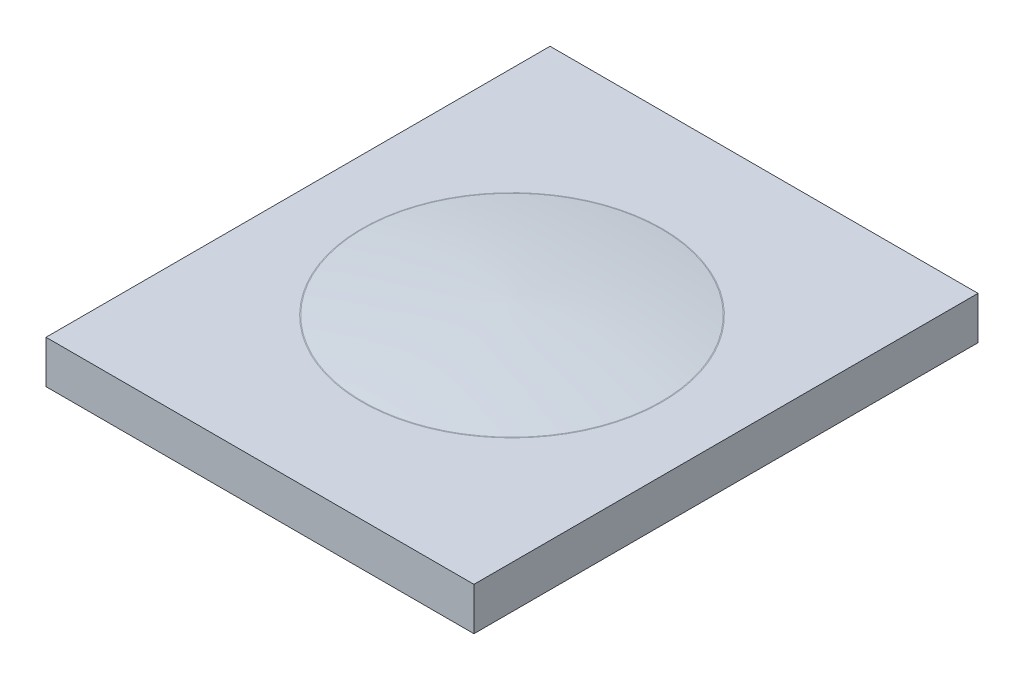
ISO-10303-21;
HEADER;
FILE_DESCRIPTION(('STEP AP214'),'2;1');
FILE_NAME('part.step','',(''),(''),'','','');
FILE_SCHEMA(('AUTOMOTIVE_DESIGN { 1 0 10303 214 1 1 1 1 }'));
ENDSEC;
DATA;
#1=APPLICATION_CONTEXT('core data for automotive mechanical design processes');
#2=APPLICATION_PROTOCOL_DEFINITION('international standard','automotive_design',2000,#1);
#3=PRODUCT_CONTEXT('',#1,'mechanical');
#4=PRODUCT('Part','Part','',(#3));
#5=PRODUCT_RELATED_PRODUCT_CATEGORY('part','',(#4));
#6=PRODUCT_DEFINITION_FORMATION('','',#4);
#7=PRODUCT_DEFINITION_CONTEXT('part definition',#1,'design');
#8=PRODUCT_DEFINITION('design','',#6,#7);
#9=PRODUCT_DEFINITION_SHAPE('','',#8);
#10=(LENGTH_UNIT() NAMED_UNIT(*) SI_UNIT(.MILLI.,.METRE.));
#11=(NAMED_UNIT(*) PLANE_ANGLE_UNIT() SI_UNIT($,.RADIAN.));
#12=(NAMED_UNIT(*) SI_UNIT($,.STERADIAN.) SOLID_ANGLE_UNIT());
#13=UNCERTAINTY_MEASURE_WITH_UNIT(LENGTH_MEASURE(1.E-05),#10,'distance_accuracy_value','');
#14=(GEOMETRIC_REPRESENTATION_CONTEXT(3) GLOBAL_UNCERTAINTY_ASSIGNED_CONTEXT((#13)) GLOBAL_UNIT_ASSIGNED_CONTEXT((#10,
#11,#12)) REPRESENTATION_CONTEXT('',''));
#15=CARTESIAN_POINT('',(0.,0.,0.));
#16=DIRECTION('',(0.,0.,1.));
#17=DIRECTION('',(1.,0.,0.));
#18=AXIS2_PLACEMENT_3D('',#15,#16,#17);
#19=CARTESIAN_POINT('',(-45.,9.,-53.));
#20=DIRECTION('',(1.,0.,0.));
#21=DIRECTION('',(0.,0.,-1.));
#22=AXIS2_PLACEMENT_3D('',#19,#20,#21);
#23=PLANE('',#22);
#24=DIRECTION('',(0.,0.,1.));
#25=VECTOR('',#24,1.);
#26=CARTESIAN_POINT('',(-45.,0.,-53.));
#27=LINE('',#26,#25);
#28=CARTESIAN_POINT('',(-45.,0.,-53.));
#29=VERTEX_POINT('',#28);
#30=CARTESIAN_POINT('',(-45.,0.,53.));
#31=VERTEX_POINT('',#30);
#32=EDGE_CURVE('E131',#29,#31,#27,.T.);
#33=ORIENTED_EDGE('',*,*,#32,.T.);
#34=DIRECTION('',(0.,-1.,0.));
#35=VECTOR('',#34,1.);
#36=CARTESIAN_POINT('',(-45.,9.,53.));
#37=LINE('',#36,#35);
#38=CARTESIAN_POINT('',(-45.,9.,53.));
#39=VERTEX_POINT('',#38);
#40=EDGE_CURVE('E129',#39,#31,#37,.T.);
#41=ORIENTED_EDGE('',*,*,#40,.F.);
#42=DIRECTION('',(0.,0.,1.));
#43=VECTOR('',#42,1.);
#44=CARTESIAN_POINT('',(-45.,9.,-53.));
#45=LINE('',#44,#43);
#46=CARTESIAN_POINT('',(-45.,9.,-53.));
#47=VERTEX_POINT('',#46);
#48=EDGE_CURVE('E126',#47,#39,#45,.T.);
#49=ORIENTED_EDGE('',*,*,#48,.F.);
#50=DIRECTION('',(0.,-1.,0.));
#51=VECTOR('',#50,1.);
#52=CARTESIAN_POINT('',(-45.,9.,-53.));
#53=LINE('',#52,#51);
#54=EDGE_CURVE('E138',#47,#29,#53,.T.);
#55=ORIENTED_EDGE('',*,*,#54,.T.);
#56=EDGE_LOOP('',(#33,#41,#49,#55));
#57=FACE_BOUND('',#56,.T.);
#58=ADVANCED_FACE('F38',(#57),#23,.F.);
#59=CARTESIAN_POINT('',(45.,9.,53.));
#60=DIRECTION('',(0.,0.,-1.));
#61=DIRECTION('',(-1.,0.,0.));
#62=AXIS2_PLACEMENT_3D('',#59,#60,#61);
#63=PLANE('',#62);
#64=DIRECTION('',(1.,0.,0.));
#65=VECTOR('',#64,1.);
#66=CARTESIAN_POINT('',(45.,0.,53.));
#67=LINE('',#66,#65);
#68=CARTESIAN_POINT('',(45.,0.,53.));
#69=VERTEX_POINT('',#68);
#70=EDGE_CURVE('E142',#31,#69,#67,.T.);
#71=ORIENTED_EDGE('',*,*,#70,.T.);
#72=DIRECTION('',(0.,-1.,0.));
#73=VECTOR('',#72,1.);
#74=CARTESIAN_POINT('',(45.,9.,53.));
#75=LINE('',#74,#73);
#76=CARTESIAN_POINT('',(45.,9.,53.));
#77=VERTEX_POINT('',#76);
#78=EDGE_CURVE('E132',#77,#69,#75,.T.);
#79=ORIENTED_EDGE('',*,*,#78,.F.);
#80=DIRECTION('',(1.,0.,0.));
#81=VECTOR('',#80,1.);
#82=CARTESIAN_POINT('',(45.,9.,53.));
#83=LINE('',#82,#81);
#84=EDGE_CURVE('E87',#39,#77,#83,.T.);
#85=ORIENTED_EDGE('',*,*,#84,.F.);
#86=ORIENTED_EDGE('',*,*,#40,.T.);
#87=EDGE_LOOP('',(#71,#79,#85,#86));
#88=FACE_BOUND('',#87,.T.);
#89=ADVANCED_FACE('F106',(#88),#63,.F.);
#90=CARTESIAN_POINT('',(45.,9.,-53.));
#91=DIRECTION('',(-1.,0.,0.));
#92=DIRECTION('',(0.,0.,1.));
#93=AXIS2_PLACEMENT_3D('',#90,#91,#92);
#94=PLANE('',#93);
#95=DIRECTION('',(0.,0.,-1.));
#96=VECTOR('',#95,1.);
#97=CARTESIAN_POINT('',(45.,0.,-53.));
#98=LINE('',#97,#96);
#99=CARTESIAN_POINT('',(45.,0.,-53.));
#100=VERTEX_POINT('',#99);
#101=EDGE_CURVE('E73',#69,#100,#98,.T.);
#102=ORIENTED_EDGE('',*,*,#101,.T.);
#103=DIRECTION('',(0.,-1.,0.));
#104=VECTOR('',#103,1.);
#105=CARTESIAN_POINT('',(45.,9.,-53.));
#106=LINE('',#105,#104);
#107=CARTESIAN_POINT('',(45.,9.,-53.));
#108=VERTEX_POINT('',#107);
#109=EDGE_CURVE('E134',#108,#100,#106,.T.);
#110=ORIENTED_EDGE('',*,*,#109,.F.);
#111=DIRECTION('',(0.,0.,-1.));
#112=VECTOR('',#111,1.);
#113=CARTESIAN_POINT('',(45.,9.,-53.));
#114=LINE('',#113,#112);
#115=EDGE_CURVE('E146',#77,#108,#114,.T.);
#116=ORIENTED_EDGE('',*,*,#115,.F.);
#117=ORIENTED_EDGE('',*,*,#78,.T.);
#118=EDGE_LOOP('',(#102,#110,#116,#117));
#119=FACE_BOUND('',#118,.T.);
#120=ADVANCED_FACE('F111',(#119),#94,.F.);
#121=CARTESIAN_POINT('',(45.,9.,-53.));
#122=DIRECTION('',(0.,0.,1.));
#123=DIRECTION('',(1.,0.,0.));
#124=AXIS2_PLACEMENT_3D('',#121,#122,#123);
#125=PLANE('',#124);
#126=DIRECTION('',(-1.,0.,0.));
#127=VECTOR('',#126,1.);
#128=CARTESIAN_POINT('',(45.,0.,-53.));
#129=LINE('',#128,#127);
#130=EDGE_CURVE('E79',#100,#29,#129,.T.);
#131=ORIENTED_EDGE('',*,*,#130,.T.);
#132=ORIENTED_EDGE('',*,*,#54,.F.);
#133=DIRECTION('',(-1.,0.,0.));
#134=VECTOR('',#133,1.);
#135=CARTESIAN_POINT('',(45.,9.,-53.));
#136=LINE('',#135,#134);
#137=EDGE_CURVE('E55',#108,#47,#136,.T.);
#138=ORIENTED_EDGE('',*,*,#137,.F.);
#139=ORIENTED_EDGE('',*,*,#109,.T.);
#140=EDGE_LOOP('',(#131,#132,#138,#139));
#141=FACE_BOUND('',#140,.T.);
#142=ADVANCED_FACE('F117',(#141),#125,.F.);
#143=CARTESIAN_POINT('',(0.,9.,0.));
#144=DIRECTION('',(0.,-1.,0.));
#145=DIRECTION('',(0.,0.,-1.));
#146=AXIS2_PLACEMENT_3D('',#143,#144,#145);
#147=PLANE('',#146);
#148=CARTESIAN_POINT('',(0.,9.,0.));
#149=DIRECTION('',(0.,-1.,0.));
#150=DIRECTION('',(0.,0.,-1.));
#151=AXIS2_PLACEMENT_3D('',#148,#149,#150);
#152=CIRCLE('',#151,31.5871787793283);
#153=CARTESIAN_POINT('',(0.,9.,-31.5871787793283));
#154=VERTEX_POINT('',#153);
#155=EDGE_CURVE('E47',#154,#154,#152,.T.);
#156=ORIENTED_EDGE('',*,*,#155,.T.);
#157=EDGE_LOOP('',(#156));
#158=FACE_BOUND('',#157,.T.);
#159=ORIENTED_EDGE('',*,*,#48,.T.);
#160=ORIENTED_EDGE('',*,*,#84,.T.);
#161=ORIENTED_EDGE('',*,*,#115,.T.);
#162=ORIENTED_EDGE('',*,*,#137,.T.);
#163=EDGE_LOOP('',(#159,#160,#161,#162));
#164=FACE_BOUND('',#163,.T.);
#165=ADVANCED_FACE('F101',(#158,#164),#147,.F.);
#166=CARTESIAN_POINT('',(0.,0.,0.));
#167=DIRECTION('',(0.,-1.,0.));
#168=DIRECTION('',(0.,0.,-1.));
#169=AXIS2_PLACEMENT_3D('',#166,#167,#168);
#170=PLANE('',#169);
#171=ORIENTED_EDGE('',*,*,#32,.F.);
#172=ORIENTED_EDGE('',*,*,#130,.F.);
#173=ORIENTED_EDGE('',*,*,#101,.F.);
#174=ORIENTED_EDGE('',*,*,#70,.F.);
#175=EDGE_LOOP('',(#171,#172,#173,#174));
#176=FACE_BOUND('',#175,.T.);
#177=ADVANCED_FACE('F93',(#176),#170,.T.);
#178=CARTESIAN_POINT('',(0.,-237.872187185631,7.9223692106768));
#179=DIRECTION('',(-1.,0.,0.));
#180=DIRECTION('',(0.,0.,-1.));
#181=AXIS2_PLACEMENT_3D('',#178,#179,#180);
#182=CIRCLE('',#181,250.);
#183=TRIMMED_CURVE('',#182,(PARAMETER_VALUE(-1.53910154367065)),
(PARAMETER_VALUE(1.53910154367065)),.T.,.PARAMETER.);
#184=CARTESIAN_POINT('',(0.,-237.872187185631,0.));
#185=DIRECTION('',(0.,-1.,0.));
#186=AXIS1_PLACEMENT('',#184,#185);
#187=SURFACE_OF_REVOLUTION('',#183,#186);
#188=CARTESIAN_POINT('',(0.,9.01370208719957,0.));
#189=DIRECTION('',(0.,-1.,0.));
#190=DIRECTION('',(0.,0.,-1.));
#191=AXIS2_PLACEMENT_3D('',#188,#189,#190);
#192=CIRCLE('',#191,31.4140983221838);
#193=CARTESIAN_POINT('',(0.,9.01370208719957,-31.4140983221838));
#194=VERTEX_POINT('',#193);
#195=EDGE_CURVE('E12',#194,#194,#192,.F.);
#196=ORIENTED_EDGE('',*,*,#195,.T.);
#197=EDGE_LOOP('',(#196));
#198=FACE_BOUND('',#197,.T.);
#199=CARTESIAN_POINT('',(0.,12.0022534162238,0.));
#200=VERTEX_POINT('',#199);
#201=VERTEX_LOOP('',#200);
#202=FACE_BOUND('',#201,.T.);
#203=ADVANCED_FACE('F91',(#198,#202),#187,.T.);
#204=CARTESIAN_POINT('',(0.,10.1,0.));
#205=DIRECTION('',(0.,-1.,0.));
#206=DIRECTION('',(0.,0.,-1.));
#207=AXIS2_PLACEMENT_3D('',#204,#205,#206);
#208=TOROIDAL_SURFACE('',#207,31.5871787793283,1.1);
#209=ORIENTED_EDGE('',*,*,#195,.F.);
#210=EDGE_LOOP('',(#209));
#211=FACE_BOUND('',#210,.T.);
#212=ORIENTED_EDGE('',*,*,#155,.F.);
#213=EDGE_LOOP('',(#212));
#214=FACE_BOUND('',#213,.T.);
#215=ADVANCED_FACE('F40',(#211,#214),#208,.F.);
#216=CLOSED_SHELL('',(#58,#89,#120,#142,#165,#177,#203,#215));
#217=MANIFOLD_SOLID_BREP('B2',#216);
#218=ADVANCED_BREP_SHAPE_REPRESENTATION('',(#18,#217),#14);
#219=SHAPE_DEFINITION_REPRESENTATION(#9,#218);
ENDSEC;
END-ISO-10303-21;
